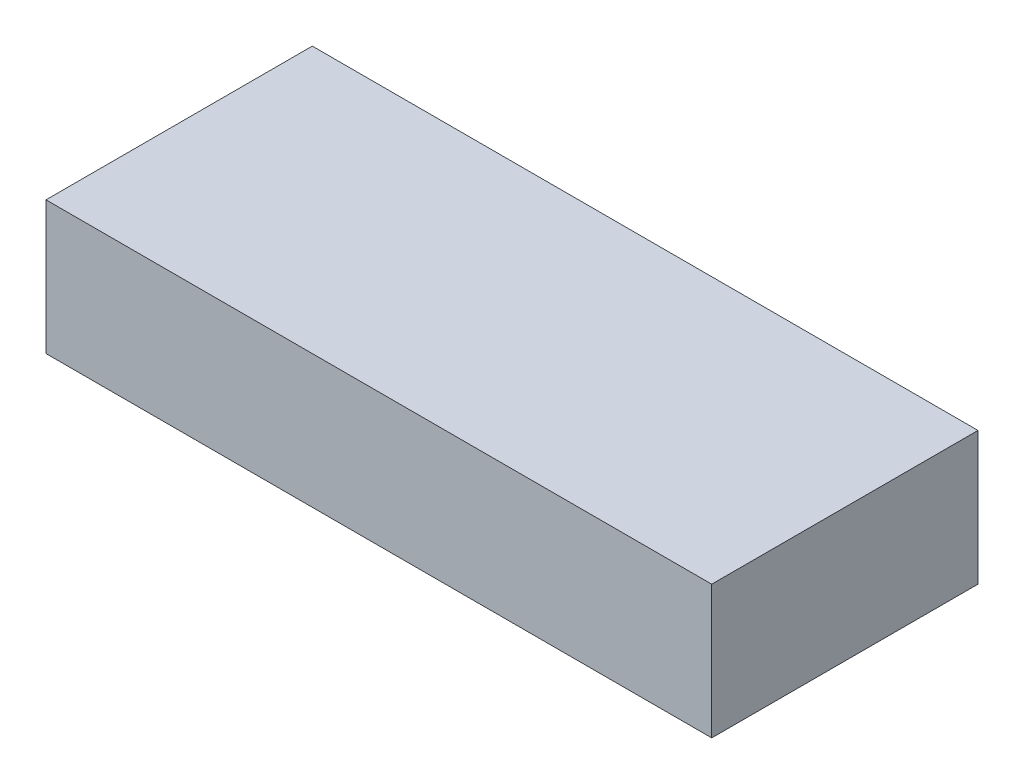
ISO-10303-21;
HEADER;
FILE_DESCRIPTION(('STEP AP214'),'2;1');
FILE_NAME('part.step','',(''),(''),'','','');
FILE_SCHEMA(('AUTOMOTIVE_DESIGN { 1 0 10303 214 1 1 1 1 }'));
ENDSEC;
DATA;
#1=APPLICATION_CONTEXT('core data for automotive mechanical design processes');
#2=APPLICATION_PROTOCOL_DEFINITION('international standard','automotive_design',2000,#1);
#3=PRODUCT_CONTEXT('',#1,'mechanical');
#4=PRODUCT('Part','Part','',(#3));
#5=PRODUCT_RELATED_PRODUCT_CATEGORY('part','',(#4));
#6=PRODUCT_DEFINITION_FORMATION('','',#4);
#7=PRODUCT_DEFINITION_CONTEXT('part definition',#1,'design');
#8=PRODUCT_DEFINITION('design','',#6,#7);
#9=PRODUCT_DEFINITION_SHAPE('','',#8);
#10=(LENGTH_UNIT() NAMED_UNIT(*) SI_UNIT(.MILLI.,.METRE.));
#11=(NAMED_UNIT(*) PLANE_ANGLE_UNIT() SI_UNIT($,.RADIAN.));
#12=(NAMED_UNIT(*) SI_UNIT($,.STERADIAN.) SOLID_ANGLE_UNIT());
#13=UNCERTAINTY_MEASURE_WITH_UNIT(LENGTH_MEASURE(1.E-05),#10,'distance_accuracy_value','');
#14=(GEOMETRIC_REPRESENTATION_CONTEXT(3) GLOBAL_UNCERTAINTY_ASSIGNED_CONTEXT((#13)) GLOBAL_UNIT_ASSIGNED_CONTEXT((#10,
#11,#12)) REPRESENTATION_CONTEXT('',''));
#15=CARTESIAN_POINT('',(0.,0.,0.));
#16=DIRECTION('',(0.,0.,1.));
#17=DIRECTION('',(1.,0.,0.));
#18=AXIS2_PLACEMENT_3D('',#15,#16,#17);
#19=CARTESIAN_POINT('',(15.,6.,-6.));
#20=DIRECTION('',(-1.,0.,0.));
#21=DIRECTION('',(0.,0.,1.));
#22=AXIS2_PLACEMENT_3D('',#19,#20,#21);
#23=PLANE('',#22);
#24=DIRECTION('',(0.,0.,-1.));
#25=VECTOR('',#24,1.);
#26=CARTESIAN_POINT('',(15.,0.,-6.));
#27=LINE('',#26,#25);
#28=CARTESIAN_POINT('',(15.,0.,6.));
#29=VERTEX_POINT('',#28);
#30=CARTESIAN_POINT('',(15.,0.,-6.));
#31=VERTEX_POINT('',#30);
#32=EDGE_CURVE('E98',#29,#31,#27,.T.);
#33=ORIENTED_EDGE('',*,*,#32,.T.);
#34=DIRECTION('',(0.,-1.,0.));
#35=VECTOR('',#34,1.);
#36=CARTESIAN_POINT('',(15.,6.,-6.));
#37=LINE('',#36,#35);
#38=CARTESIAN_POINT('',(15.,6.,-6.));
#39=VERTEX_POINT('',#38);
#40=EDGE_CURVE('E11',#39,#31,#37,.T.);
#41=ORIENTED_EDGE('',*,*,#40,.F.);
#42=DIRECTION('',(0.,0.,-1.));
#43=VECTOR('',#42,1.);
#44=CARTESIAN_POINT('',(15.,6.,-6.));
#45=LINE('',#44,#43);
#46=CARTESIAN_POINT('',(15.,6.,6.));
#47=VERTEX_POINT('',#46);
#48=EDGE_CURVE('E86',#47,#39,#45,.T.);
#49=ORIENTED_EDGE('',*,*,#48,.F.);
#50=DIRECTION('',(0.,-1.,0.));
#51=VECTOR('',#50,1.);
#52=CARTESIAN_POINT('',(15.,6.,6.));
#53=LINE('',#52,#51);
#54=EDGE_CURVE('E94',#47,#29,#53,.T.);
#55=ORIENTED_EDGE('',*,*,#54,.T.);
#56=EDGE_LOOP('',(#33,#41,#49,#55));
#57=FACE_BOUND('',#56,.T.);
#58=ADVANCED_FACE('F35',(#57),#23,.F.);
#59=CARTESIAN_POINT('',(-15.,6.,-6.));
#60=DIRECTION('',(0.,0.,1.));
#61=DIRECTION('',(1.,0.,0.));
#62=AXIS2_PLACEMENT_3D('',#59,#60,#61);
#63=PLANE('',#62);
#64=DIRECTION('',(-1.,0.,0.));
#65=VECTOR('',#64,1.);
#66=CARTESIAN_POINT('',(-15.,0.,-6.));
#67=LINE('',#66,#65);
#68=CARTESIAN_POINT('',(-15.,0.,-6.));
#69=VERTEX_POINT('',#68);
#70=EDGE_CURVE('E90',#31,#69,#67,.T.);
#71=ORIENTED_EDGE('',*,*,#70,.T.);
#72=DIRECTION('',(0.,-1.,0.));
#73=VECTOR('',#72,1.);
#74=CARTESIAN_POINT('',(-15.,6.,-6.));
#75=LINE('',#74,#73);
#76=CARTESIAN_POINT('',(-15.,6.,-6.));
#77=VERTEX_POINT('',#76);
#78=EDGE_CURVE('E43',#77,#69,#75,.T.);
#79=ORIENTED_EDGE('',*,*,#78,.F.);
#80=DIRECTION('',(-1.,0.,0.));
#81=VECTOR('',#80,1.);
#82=CARTESIAN_POINT('',(-15.,6.,-6.));
#83=LINE('',#82,#81);
#84=EDGE_CURVE('E81',#39,#77,#83,.T.);
#85=ORIENTED_EDGE('',*,*,#84,.F.);
#86=ORIENTED_EDGE('',*,*,#40,.T.);
#87=EDGE_LOOP('',(#71,#79,#85,#86));
#88=FACE_BOUND('',#87,.T.);
#89=ADVANCED_FACE('F89',(#88),#63,.F.);
#90=CARTESIAN_POINT('',(-15.,6.,-6.));
#91=DIRECTION('',(1.,0.,0.));
#92=DIRECTION('',(0.,0.,-1.));
#93=AXIS2_PLACEMENT_3D('',#90,#91,#92);
#94=PLANE('',#93);
#95=DIRECTION('',(0.,0.,1.));
#96=VECTOR('',#95,1.);
#97=CARTESIAN_POINT('',(-15.,0.,-6.));
#98=LINE('',#97,#96);
#99=CARTESIAN_POINT('',(-15.,0.,6.));
#100=VERTEX_POINT('',#99);
#101=EDGE_CURVE('E68',#69,#100,#98,.T.);
#102=ORIENTED_EDGE('',*,*,#101,.T.);
#103=DIRECTION('',(0.,-1.,0.));
#104=VECTOR('',#103,1.);
#105=CARTESIAN_POINT('',(-15.,6.,6.));
#106=LINE('',#105,#104);
#107=CARTESIAN_POINT('',(-15.,6.,6.));
#108=VERTEX_POINT('',#107);
#109=EDGE_CURVE('E91',#108,#100,#106,.T.);
#110=ORIENTED_EDGE('',*,*,#109,.F.);
#111=DIRECTION('',(0.,0.,1.));
#112=VECTOR('',#111,1.);
#113=CARTESIAN_POINT('',(-15.,6.,-6.));
#114=LINE('',#113,#112);
#115=EDGE_CURVE('E84',#77,#108,#114,.T.);
#116=ORIENTED_EDGE('',*,*,#115,.F.);
#117=ORIENTED_EDGE('',*,*,#78,.T.);
#118=EDGE_LOOP('',(#102,#110,#116,#117));
#119=FACE_BOUND('',#118,.T.);
#120=ADVANCED_FACE('F92',(#119),#94,.F.);
#121=CARTESIAN_POINT('',(-15.,6.,6.));
#122=DIRECTION('',(0.,0.,-1.));
#123=DIRECTION('',(-1.,0.,0.));
#124=AXIS2_PLACEMENT_3D('',#121,#122,#123);
#125=PLANE('',#124);
#126=DIRECTION('',(1.,0.,0.));
#127=VECTOR('',#126,1.);
#128=CARTESIAN_POINT('',(-15.,0.,6.));
#129=LINE('',#128,#127);
#130=EDGE_CURVE('E74',#100,#29,#129,.T.);
#131=ORIENTED_EDGE('',*,*,#130,.T.);
#132=ORIENTED_EDGE('',*,*,#54,.F.);
#133=DIRECTION('',(1.,0.,0.));
#134=VECTOR('',#133,1.);
#135=CARTESIAN_POINT('',(-15.,6.,6.));
#136=LINE('',#135,#134);
#137=EDGE_CURVE('E51',#108,#47,#136,.T.);
#138=ORIENTED_EDGE('',*,*,#137,.F.);
#139=ORIENTED_EDGE('',*,*,#109,.T.);
#140=EDGE_LOOP('',(#131,#132,#138,#139));
#141=FACE_BOUND('',#140,.T.);
#142=ADVANCED_FACE('F105',(#141),#125,.F.);
#143=CARTESIAN_POINT('',(0.,6.,0.));
#144=DIRECTION('',(0.,1.,0.));
#145=DIRECTION('',(0.,0.,1.));
#146=AXIS2_PLACEMENT_3D('',#143,#144,#145);
#147=PLANE('',#146);
#148=ORIENTED_EDGE('',*,*,#48,.T.);
#149=ORIENTED_EDGE('',*,*,#84,.T.);
#150=ORIENTED_EDGE('',*,*,#115,.T.);
#151=ORIENTED_EDGE('',*,*,#137,.T.);
#152=EDGE_LOOP('',(#148,#149,#150,#151));
#153=FACE_BOUND('',#152,.T.);
#154=ADVANCED_FACE('F82',(#153),#147,.T.);
#155=CARTESIAN_POINT('',(0.,0.,0.));
#156=DIRECTION('',(0.,1.,0.));
#157=DIRECTION('',(0.,0.,1.));
#158=AXIS2_PLACEMENT_3D('',#155,#156,#157);
#159=PLANE('',#158);
#160=ORIENTED_EDGE('',*,*,#32,.F.);
#161=ORIENTED_EDGE('',*,*,#130,.F.);
#162=ORIENTED_EDGE('',*,*,#101,.F.);
#163=ORIENTED_EDGE('',*,*,#70,.F.);
#164=EDGE_LOOP('',(#160,#161,#162,#163));
#165=FACE_BOUND('',#164,.T.);
#166=ADVANCED_FACE('F108',(#165),#159,.F.);
#167=CLOSED_SHELL('',(#58,#89,#120,#142,#154,#166));
#168=MANIFOLD_SOLID_BREP('B2',#167);
#169=ADVANCED_BREP_SHAPE_REPRESENTATION('',(#18,#168),#14);
#170=SHAPE_DEFINITION_REPRESENTATION(#9,#169);
ENDSEC;
END-ISO-10303-21;
